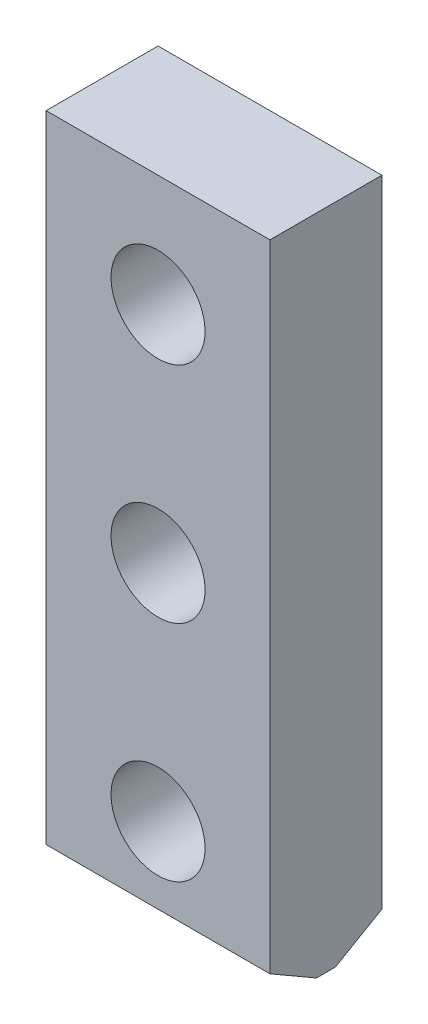
ISO-10303-21;
HEADER;
FILE_DESCRIPTION(('STEP AP214'),'2;1');
FILE_NAME('part.step','',(''),(''),'','','');
FILE_SCHEMA(('AUTOMOTIVE_DESIGN { 1 0 10303 214 1 1 1 1 }'));
ENDSEC;
DATA;
#1=APPLICATION_CONTEXT('core data for automotive mechanical design processes');
#2=APPLICATION_PROTOCOL_DEFINITION('international standard','automotive_design',2000,#1);
#3=PRODUCT_CONTEXT('',#1,'mechanical');
#4=PRODUCT('Part','Part','',(#3));
#5=PRODUCT_RELATED_PRODUCT_CATEGORY('part','',(#4));
#6=PRODUCT_DEFINITION_FORMATION('','',#4);
#7=PRODUCT_DEFINITION_CONTEXT('part definition',#1,'design');
#8=PRODUCT_DEFINITION('design','',#6,#7);
#9=PRODUCT_DEFINITION_SHAPE('','',#8);
#10=(LENGTH_UNIT() NAMED_UNIT(*) SI_UNIT(.MILLI.,.METRE.));
#11=(NAMED_UNIT(*) PLANE_ANGLE_UNIT() SI_UNIT($,.RADIAN.));
#12=(NAMED_UNIT(*) SI_UNIT($,.STERADIAN.) SOLID_ANGLE_UNIT());
#13=UNCERTAINTY_MEASURE_WITH_UNIT(LENGTH_MEASURE(1.E-05),#10,'distance_accuracy_value','');
#14=(GEOMETRIC_REPRESENTATION_CONTEXT(3) GLOBAL_UNCERTAINTY_ASSIGNED_CONTEXT((#13)) GLOBAL_UNIT_ASSIGNED_CONTEXT((#10,
#11,#12)) REPRESENTATION_CONTEXT('',''));
#15=CARTESIAN_POINT('',(0.,0.,0.));
#16=DIRECTION('',(0.,0.,1.));
#17=DIRECTION('',(1.,0.,0.));
#18=AXIS2_PLACEMENT_3D('',#15,#16,#17);
#19=CARTESIAN_POINT('',(0.,0.,25.));
#20=DIRECTION('',(1.,0.,0.));
#21=DIRECTION('',(0.,1.,0.));
#22=AXIS2_PLACEMENT_3D('',#19,#20,#21);
#23=PLANE('',#22);
#24=DIRECTION('',(0.,0.,-1.));
#25=VECTOR('',#24,1.);
#26=CARTESIAN_POINT('',(0.,0.,25.));
#27=LINE('',#26,#25);
#28=CARTESIAN_POINT('',(0.,0.,14.6076951545867));
#29=VERTEX_POINT('',#28);
#30=CARTESIAN_POINT('',(0.,0.,10.3923048454133));
#31=VERTEX_POINT('',#30);
#32=EDGE_CURVE('E120',#29,#31,#27,.T.);
#33=ORIENTED_EDGE('',*,*,#32,.F.);
#34=DIRECTION('',(0.,-0.500000000000001,-0.866025403784438));
#35=VECTOR('',#34,1.);
#36=CARTESIAN_POINT('',(0.,6.00000000000001,25.));
#37=LINE('',#36,#35);
#38=CARTESIAN_POINT('',(0.,6.00000000000001,25.));
#39=VERTEX_POINT('',#38);
#40=EDGE_CURVE('E11',#29,#39,#37,.F.);
#41=ORIENTED_EDGE('',*,*,#40,.T.);
#42=DIRECTION('',(0.,-1.,0.));
#43=VECTOR('',#42,1.);
#44=CARTESIAN_POINT('',(0.,0.,25.));
#45=LINE('',#44,#43);
#46=CARTESIAN_POINT('',(0.,148.,25.));
#47=VERTEX_POINT('',#46);
#48=EDGE_CURVE('E93',#47,#39,#45,.T.);
#49=ORIENTED_EDGE('',*,*,#48,.F.);
#50=DIRECTION('',(0.,0.,-1.));
#51=VECTOR('',#50,1.);
#52=CARTESIAN_POINT('',(0.,148.,25.));
#53=LINE('',#52,#51);
#54=CARTESIAN_POINT('',(0.,148.,0.));
#55=VERTEX_POINT('',#54);
#56=EDGE_CURVE('E103',#47,#55,#53,.T.);
#57=ORIENTED_EDGE('',*,*,#56,.T.);
#58=DIRECTION('',(0.,-1.,0.));
#59=VECTOR('',#58,1.);
#60=CARTESIAN_POINT('',(0.,0.,0.));
#61=LINE('',#60,#59);
#62=CARTESIAN_POINT('',(0.,6.00000000000002,0.));
#63=VERTEX_POINT('',#62);
#64=EDGE_CURVE('E112',#55,#63,#61,.T.);
#65=ORIENTED_EDGE('',*,*,#64,.T.);
#66=DIRECTION('',(0.,-0.5,0.866025403784438));
#67=VECTOR('',#66,1.);
#68=CARTESIAN_POINT('',(0.,0.,10.3923048454133));
#69=LINE('',#68,#67);
#70=EDGE_CURVE('E129',#63,#31,#69,.T.);
#71=ORIENTED_EDGE('',*,*,#70,.T.);
#72=EDGE_LOOP('',(#33,#41,#49,#57,#65,#71));
#73=FACE_BOUND('',#72,.T.);
#74=ADVANCED_FACE('F34',(#73),#23,.F.);
#75=CARTESIAN_POINT('',(0.,0.,25.));
#76=DIRECTION('',(0.,1.,0.));
#77=DIRECTION('',(-1.,0.,0.));
#78=AXIS2_PLACEMENT_3D('',#75,#76,#77);
#79=PLANE('',#78);
#80=DIRECTION('',(0.,0.,-1.));
#81=VECTOR('',#80,1.);
#82=CARTESIAN_POINT('',(50.0000000000001,0.,25.));
#83=LINE('',#82,#81);
#84=CARTESIAN_POINT('',(50.0000000000001,0.,14.6076951545867));
#85=VERTEX_POINT('',#84);
#86=CARTESIAN_POINT('',(50.0000000000001,0.,10.3923048454133));
#87=VERTEX_POINT('',#86);
#88=EDGE_CURVE('E102',#85,#87,#83,.T.);
#89=ORIENTED_EDGE('',*,*,#88,.F.);
#90=DIRECTION('',(-1.,0.,0.));
#91=VECTOR('',#90,1.);
#92=CARTESIAN_POINT('',(0.,0.,14.6076951545867));
#93=LINE('',#92,#91);
#94=EDGE_CURVE('E42',#85,#29,#93,.T.);
#95=ORIENTED_EDGE('',*,*,#94,.T.);
#96=ORIENTED_EDGE('',*,*,#32,.T.);
#97=DIRECTION('',(1.,0.,0.));
#98=VECTOR('',#97,1.);
#99=CARTESIAN_POINT('',(50.0000000000001,0.,10.3923048454133));
#100=LINE('',#99,#98);
#101=EDGE_CURVE('E122',#31,#87,#100,.T.);
#102=ORIENTED_EDGE('',*,*,#101,.T.);
#103=EDGE_LOOP('',(#89,#95,#96,#102));
#104=FACE_BOUND('',#103,.T.);
#105=ADVANCED_FACE('F142',(#104),#79,.F.);
#106=CARTESIAN_POINT('',(50.0000000000001,0.,25.));
#107=DIRECTION('',(-1.,0.,0.));
#108=DIRECTION('',(0.,-1.,0.));
#109=AXIS2_PLACEMENT_3D('',#106,#107,#108);
#110=PLANE('',#109);
#111=DIRECTION('',(0.,1.,0.));
#112=VECTOR('',#111,1.);
#113=CARTESIAN_POINT('',(50.0000000000001,0.,25.));
#114=LINE('',#113,#112);
#115=CARTESIAN_POINT('',(50.0000000000001,6.00000000000002,25.));
#116=VERTEX_POINT('',#115);
#117=CARTESIAN_POINT('',(50.,148.,25.));
#118=VERTEX_POINT('',#117);
#119=EDGE_CURVE('E84',#116,#118,#114,.T.);
#120=ORIENTED_EDGE('',*,*,#119,.F.);
#121=DIRECTION('',(0.,0.500000000000001,0.866025403784438));
#122=VECTOR('',#121,1.);
#123=CARTESIAN_POINT('',(50.0000000000001,6.00000000000002,25.));
#124=LINE('',#123,#122);
#125=EDGE_CURVE('E56',#116,#85,#124,.F.);
#126=ORIENTED_EDGE('',*,*,#125,.T.);
#127=ORIENTED_EDGE('',*,*,#88,.T.);
#128=DIRECTION('',(0.,0.5,-0.866025403784438));
#129=VECTOR('',#128,1.);
#130=CARTESIAN_POINT('',(50.0000000000001,0.,10.3923048454133));
#131=LINE('',#130,#129);
#132=CARTESIAN_POINT('',(50.0000000000001,6.00000000000003,0.));
#133=VERTEX_POINT('',#132);
#134=EDGE_CURVE('E125',#87,#133,#131,.T.);
#135=ORIENTED_EDGE('',*,*,#134,.T.);
#136=DIRECTION('',(0.,1.,0.));
#137=VECTOR('',#136,1.);
#138=CARTESIAN_POINT('',(50.0000000000001,0.,0.));
#139=LINE('',#138,#137);
#140=CARTESIAN_POINT('',(50.,148.,0.));
#141=VERTEX_POINT('',#140);
#142=EDGE_CURVE('E99',#133,#141,#139,.T.);
#143=ORIENTED_EDGE('',*,*,#142,.T.);
#144=DIRECTION('',(0.,0.,-1.));
#145=VECTOR('',#144,1.);
#146=CARTESIAN_POINT('',(50.,148.,25.));
#147=LINE('',#146,#145);
#148=EDGE_CURVE('E96',#118,#141,#147,.T.);
#149=ORIENTED_EDGE('',*,*,#148,.F.);
#150=EDGE_LOOP('',(#120,#126,#127,#135,#143,#149));
#151=FACE_BOUND('',#150,.T.);
#152=ADVANCED_FACE('F97',(#151),#110,.F.);
#153=CARTESIAN_POINT('',(0.,148.,25.));
#154=DIRECTION('',(0.,-1.,0.));
#155=DIRECTION('',(0.,0.,-1.));
#156=AXIS2_PLACEMENT_3D('',#153,#154,#155);
#157=PLANE('',#156);
#158=DIRECTION('',(-1.,0.,0.));
#159=VECTOR('',#158,1.);
#160=CARTESIAN_POINT('',(0.,148.,0.));
#161=LINE('',#160,#159);
#162=EDGE_CURVE('E117',#141,#55,#161,.T.);
#163=ORIENTED_EDGE('',*,*,#162,.T.);
#164=ORIENTED_EDGE('',*,*,#56,.F.);
#165=DIRECTION('',(-1.,0.,0.));
#166=VECTOR('',#165,1.);
#167=CARTESIAN_POINT('',(0.,148.,25.));
#168=LINE('',#167,#166);
#169=EDGE_CURVE('E89',#118,#47,#168,.T.);
#170=ORIENTED_EDGE('',*,*,#169,.F.);
#171=ORIENTED_EDGE('',*,*,#148,.T.);
#172=EDGE_LOOP('',(#163,#164,#170,#171));
#173=FACE_BOUND('',#172,.T.);
#174=ADVANCED_FACE('F105',(#173),#157,.F.);
#175=CARTESIAN_POINT('',(0.,0.,25.));
#176=DIRECTION('',(0.,0.,-1.));
#177=DIRECTION('',(-1.,0.,0.));
#178=AXIS2_PLACEMENT_3D('',#175,#176,#177);
#179=PLANE('',#178);
#180=CARTESIAN_POINT('',(25.0000000000001,73.,25.));
#181=DIRECTION('',(0.,0.,1.));
#182=DIRECTION('',(1.,0.,0.));
#183=AXIS2_PLACEMENT_3D('',#180,#181,#182);
#184=CIRCLE('',#183,10.5);
#185=CARTESIAN_POINT('',(35.5000000000001,73.,25.));
#186=VERTEX_POINT('',#185);
#187=EDGE_CURVE('E157',#186,#186,#184,.T.);
#188=ORIENTED_EDGE('',*,*,#187,.F.);
#189=EDGE_LOOP('',(#188));
#190=FACE_BOUND('',#189,.T.);
#191=CARTESIAN_POINT('',(25.0000000000001,123.,25.));
#192=DIRECTION('',(0.,0.,1.));
#193=DIRECTION('',(1.,0.,0.));
#194=AXIS2_PLACEMENT_3D('',#191,#192,#193);
#195=CIRCLE('',#194,10.5);
#196=CARTESIAN_POINT('',(35.5000000000001,123.,25.));
#197=VERTEX_POINT('',#196);
#198=EDGE_CURVE('E151',#197,#197,#195,.T.);
#199=ORIENTED_EDGE('',*,*,#198,.F.);
#200=EDGE_LOOP('',(#199));
#201=FACE_BOUND('',#200,.T.);
#202=CARTESIAN_POINT('',(25.0000000000001,23.,25.));
#203=DIRECTION('',(0.,0.,1.));
#204=DIRECTION('',(1.,0.,0.));
#205=AXIS2_PLACEMENT_3D('',#202,#203,#204);
#206=CIRCLE('',#205,10.5);
#207=CARTESIAN_POINT('',(35.5000000000001,23.,25.));
#208=VERTEX_POINT('',#207);
#209=EDGE_CURVE('E145',#208,#208,#206,.T.);
#210=ORIENTED_EDGE('',*,*,#209,.F.);
#211=EDGE_LOOP('',(#210));
#212=FACE_BOUND('',#211,.T.);
#213=ORIENTED_EDGE('',*,*,#48,.T.);
#214=DIRECTION('',(1.,0.,0.));
#215=VECTOR('',#214,1.);
#216=CARTESIAN_POINT('',(0.,6.00000000000001,25.));
#217=LINE('',#216,#215);
#218=EDGE_CURVE('E92',#39,#116,#217,.T.);
#219=ORIENTED_EDGE('',*,*,#218,.T.);
#220=ORIENTED_EDGE('',*,*,#119,.T.);
#221=ORIENTED_EDGE('',*,*,#169,.T.);
#222=EDGE_LOOP('',(#213,#219,#220,#221));
#223=FACE_BOUND('',#222,.T.);
#224=ADVANCED_FACE('F87',(#190,#201,#212,#223),#179,.F.);
#225=CARTESIAN_POINT('',(0.,0.,0.));
#226=DIRECTION('',(0.,0.,-1.));
#227=DIRECTION('',(-1.,0.,0.));
#228=AXIS2_PLACEMENT_3D('',#225,#226,#227);
#229=PLANE('',#228);
#230=CARTESIAN_POINT('',(25.0000000000001,73.,0.));
#231=DIRECTION('',(0.,0.,1.));
#232=DIRECTION('',(1.,0.,0.));
#233=AXIS2_PLACEMENT_3D('',#230,#231,#232);
#234=CIRCLE('',#233,10.5);
#235=CARTESIAN_POINT('',(35.5000000000001,73.,0.));
#236=VERTEX_POINT('',#235);
#237=EDGE_CURVE('E148',#236,#236,#234,.T.);
#238=ORIENTED_EDGE('',*,*,#237,.T.);
#239=EDGE_LOOP('',(#238));
#240=FACE_BOUND('',#239,.T.);
#241=CARTESIAN_POINT('',(25.0000000000001,123.,0.));
#242=DIRECTION('',(0.,0.,1.));
#243=DIRECTION('',(1.,0.,0.));
#244=AXIS2_PLACEMENT_3D('',#241,#242,#243);
#245=CIRCLE('',#244,10.5);
#246=CARTESIAN_POINT('',(35.5000000000001,123.,0.));
#247=VERTEX_POINT('',#246);
#248=EDGE_CURVE('E154',#247,#247,#245,.T.);
#249=ORIENTED_EDGE('',*,*,#248,.T.);
#250=EDGE_LOOP('',(#249));
#251=FACE_BOUND('',#250,.T.);
#252=CARTESIAN_POINT('',(25.0000000000001,23.,0.));
#253=DIRECTION('',(0.,0.,1.));
#254=DIRECTION('',(1.,0.,0.));
#255=AXIS2_PLACEMENT_3D('',#252,#253,#254);
#256=CIRCLE('',#255,10.5);
#257=CARTESIAN_POINT('',(35.5000000000001,23.,0.));
#258=VERTEX_POINT('',#257);
#259=EDGE_CURVE('E115',#258,#258,#256,.T.);
#260=ORIENTED_EDGE('',*,*,#259,.T.);
#261=EDGE_LOOP('',(#260));
#262=FACE_BOUND('',#261,.T.);
#263=ORIENTED_EDGE('',*,*,#142,.F.);
#264=DIRECTION('',(-1.,0.,0.));
#265=VECTOR('',#264,1.);
#266=CARTESIAN_POINT('',(0.,6.00000000000002,0.));
#267=LINE('',#266,#265);
#268=EDGE_CURVE('E127',#133,#63,#267,.T.);
#269=ORIENTED_EDGE('',*,*,#268,.T.);
#270=ORIENTED_EDGE('',*,*,#64,.F.);
#271=ORIENTED_EDGE('',*,*,#162,.F.);
#272=EDGE_LOOP('',(#263,#269,#270,#271));
#273=FACE_BOUND('',#272,.T.);
#274=ADVANCED_FACE('F163',(#240,#251,#262,#273),#229,.T.);
#275=CARTESIAN_POINT('',(25.0000000000001,23.,0.));
#276=DIRECTION('',(0.,0.,1.));
#277=DIRECTION('',(1.,0.,0.));
#278=AXIS2_PLACEMENT_3D('',#275,#276,#277);
#279=CYLINDRICAL_SURFACE('',#278,10.5);
#280=ORIENTED_EDGE('',*,*,#259,.F.);
#281=EDGE_LOOP('',(#280));
#282=FACE_BOUND('',#281,.T.);
#283=ORIENTED_EDGE('',*,*,#209,.T.);
#284=EDGE_LOOP('',(#283));
#285=FACE_BOUND('',#284,.T.);
#286=ADVANCED_FACE('F180',(#282,#285),#279,.F.);
#287=CARTESIAN_POINT('',(25.0000000000001,123.,0.));
#288=DIRECTION('',(0.,0.,1.));
#289=DIRECTION('',(1.,0.,0.));
#290=AXIS2_PLACEMENT_3D('',#287,#288,#289);
#291=CYLINDRICAL_SURFACE('',#290,10.5);
#292=ORIENTED_EDGE('',*,*,#248,.F.);
#293=EDGE_LOOP('',(#292));
#294=FACE_BOUND('',#293,.T.);
#295=ORIENTED_EDGE('',*,*,#198,.T.);
#296=EDGE_LOOP('',(#295));
#297=FACE_BOUND('',#296,.T.);
#298=ADVANCED_FACE('F169',(#294,#297),#291,.F.);
#299=CARTESIAN_POINT('',(25.0000000000001,73.,0.));
#300=DIRECTION('',(0.,0.,1.));
#301=DIRECTION('',(1.,0.,0.));
#302=AXIS2_PLACEMENT_3D('',#299,#300,#301);
#303=CYLINDRICAL_SURFACE('',#302,10.5);
#304=ORIENTED_EDGE('',*,*,#237,.F.);
#305=EDGE_LOOP('',(#304));
#306=FACE_BOUND('',#305,.T.);
#307=ORIENTED_EDGE('',*,*,#187,.T.);
#308=EDGE_LOOP('',(#307));
#309=FACE_BOUND('',#308,.T.);
#310=ADVANCED_FACE('F166',(#306,#309),#303,.F.);
#311=CARTESIAN_POINT('',(0.,0.,10.3923048454133));
#312=DIRECTION('',(0.,-0.866025403784438,-0.5));
#313=DIRECTION('',(-1.,0.,0.));
#314=AXIS2_PLACEMENT_3D('',#311,#312,#313);
#315=PLANE('',#314);
#316=ORIENTED_EDGE('',*,*,#70,.F.);
#317=ORIENTED_EDGE('',*,*,#268,.F.);
#318=ORIENTED_EDGE('',*,*,#134,.F.);
#319=ORIENTED_EDGE('',*,*,#101,.F.);
#320=EDGE_LOOP('',(#316,#317,#318,#319));
#321=FACE_BOUND('',#320,.T.);
#322=ADVANCED_FACE('F141',(#321),#315,.T.);
#323=CARTESIAN_POINT('',(0.,6.00000000000001,25.));
#324=DIRECTION('',(0.,0.866025403784438,-0.500000000000001));
#325=DIRECTION('',(1.,0.,0.));
#326=AXIS2_PLACEMENT_3D('',#323,#324,#325);
#327=PLANE('',#326);
#328=ORIENTED_EDGE('',*,*,#40,.F.);
#329=ORIENTED_EDGE('',*,*,#94,.F.);
#330=ORIENTED_EDGE('',*,*,#125,.F.);
#331=ORIENTED_EDGE('',*,*,#218,.F.);
#332=EDGE_LOOP('',(#328,#329,#330,#331));
#333=FACE_BOUND('',#332,.T.);
#334=ADVANCED_FACE('F36',(#333),#327,.F.);
#335=CLOSED_SHELL('',(#74,#105,#152,#174,#224,#274,#286,#298,#310,#322,#334));
#336=MANIFOLD_SOLID_BREP('B2',#335);
#337=ADVANCED_BREP_SHAPE_REPRESENTATION('',(#18,#336),#14);
#338=SHAPE_DEFINITION_REPRESENTATION(#9,#337);
ENDSEC;
END-ISO-10303-21;
